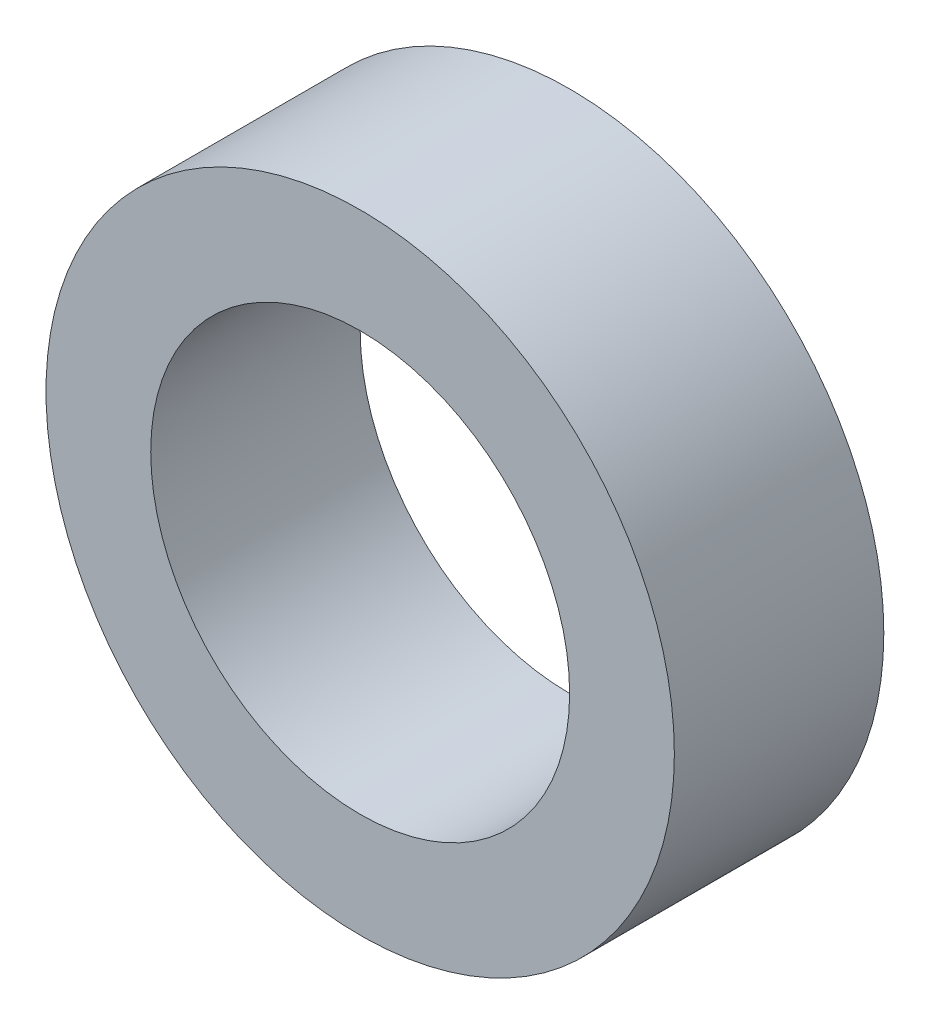
ISO-10303-21;
HEADER;
FILE_DESCRIPTION(('STEP AP214'),'2;1');
FILE_NAME('part.step','',(''),(''),'','','');
FILE_SCHEMA(('AUTOMOTIVE_DESIGN { 1 0 10303 214 1 1 1 1 }'));
ENDSEC;
DATA;
#1=APPLICATION_CONTEXT('core data for automotive mechanical design processes');
#2=APPLICATION_PROTOCOL_DEFINITION('international standard','automotive_design',2000,#1);
#3=PRODUCT_CONTEXT('',#1,'mechanical');
#4=PRODUCT('Part','Part','',(#3));
#5=PRODUCT_RELATED_PRODUCT_CATEGORY('part','',(#4));
#6=PRODUCT_DEFINITION_FORMATION('','',#4);
#7=PRODUCT_DEFINITION_CONTEXT('part definition',#1,'design');
#8=PRODUCT_DEFINITION('design','',#6,#7);
#9=PRODUCT_DEFINITION_SHAPE('','',#8);
#10=(LENGTH_UNIT() NAMED_UNIT(*) SI_UNIT(.MILLI.,.METRE.));
#11=(NAMED_UNIT(*) PLANE_ANGLE_UNIT() SI_UNIT($,.RADIAN.));
#12=(NAMED_UNIT(*) SI_UNIT($,.STERADIAN.) SOLID_ANGLE_UNIT());
#13=UNCERTAINTY_MEASURE_WITH_UNIT(LENGTH_MEASURE(1.E-05),#10,'distance_accuracy_value','');
#14=(GEOMETRIC_REPRESENTATION_CONTEXT(3) GLOBAL_UNCERTAINTY_ASSIGNED_CONTEXT((#13)) GLOBAL_UNIT_ASSIGNED_CONTEXT((#10,
#11,#12)) REPRESENTATION_CONTEXT('',''));
#15=CARTESIAN_POINT('',(0.,0.,0.));
#16=DIRECTION('',(0.,0.,1.));
#17=DIRECTION('',(1.,0.,0.));
#18=AXIS2_PLACEMENT_3D('',#15,#16,#17);
#19=CARTESIAN_POINT('',(0.,0.,4.));
#20=DIRECTION('',(0.,0.,1.));
#21=DIRECTION('',(1.,0.,0.));
#22=AXIS2_PLACEMENT_3D('',#19,#20,#21);
#23=PLANE('',#22);
#24=CARTESIAN_POINT('',(0.,0.,4.));
#25=DIRECTION('',(0.,0.,1.));
#26=DIRECTION('',(1.,0.,0.));
#27=AXIS2_PLACEMENT_3D('',#24,#25,#26);
#28=CIRCLE('',#27,6.);
#29=CARTESIAN_POINT('',(6.,0.,4.));
#30=VERTEX_POINT('',#29);
#31=EDGE_CURVE('E10',#30,#30,#28,.T.);
#32=ORIENTED_EDGE('',*,*,#31,.T.);
#33=EDGE_LOOP('',(#32));
#34=FACE_BOUND('',#33,.T.);
#35=CARTESIAN_POINT('',(0.,0.,4.));
#36=DIRECTION('',(0.,0.,1.));
#37=DIRECTION('',(1.,0.,0.));
#38=AXIS2_PLACEMENT_3D('',#35,#36,#37);
#39=CIRCLE('',#38,4.);
#40=CARTESIAN_POINT('',(4.,0.,4.));
#41=VERTEX_POINT('',#40);
#42=EDGE_CURVE('E41',#41,#41,#39,.T.);
#43=ORIENTED_EDGE('',*,*,#42,.F.);
#44=EDGE_LOOP('',(#43));
#45=FACE_BOUND('',#44,.T.);
#46=ADVANCED_FACE('F30',(#34,#45),#23,.T.);
#47=CARTESIAN_POINT('',(0.,0.,0.));
#48=DIRECTION('',(0.,0.,1.));
#49=DIRECTION('',(1.,0.,0.));
#50=AXIS2_PLACEMENT_3D('',#47,#48,#49);
#51=PLANE('',#50);
#52=CARTESIAN_POINT('',(0.,0.,0.));
#53=DIRECTION('',(0.,0.,1.));
#54=DIRECTION('',(1.,0.,0.));
#55=AXIS2_PLACEMENT_3D('',#52,#53,#54);
#56=CIRCLE('',#55,6.);
#57=CARTESIAN_POINT('',(6.,0.,0.));
#58=VERTEX_POINT('',#57);
#59=EDGE_CURVE('E34',#58,#58,#56,.T.);
#60=ORIENTED_EDGE('',*,*,#59,.F.);
#61=EDGE_LOOP('',(#60));
#62=FACE_BOUND('',#61,.T.);
#63=CARTESIAN_POINT('',(0.,0.,0.));
#64=DIRECTION('',(0.,0.,1.));
#65=DIRECTION('',(1.,0.,0.));
#66=AXIS2_PLACEMENT_3D('',#63,#64,#65);
#67=CIRCLE('',#66,4.);
#68=CARTESIAN_POINT('',(4.,0.,0.));
#69=VERTEX_POINT('',#68);
#70=EDGE_CURVE('E43',#69,#69,#67,.T.);
#71=ORIENTED_EDGE('',*,*,#70,.T.);
#72=EDGE_LOOP('',(#71));
#73=FACE_BOUND('',#72,.T.);
#74=ADVANCED_FACE('F53',(#62,#73),#51,.F.);
#75=CARTESIAN_POINT('',(0.,0.,4.));
#76=DIRECTION('',(0.,0.,-1.));
#77=DIRECTION('',(-1.,0.,0.));
#78=AXIS2_PLACEMENT_3D('',#75,#76,#77);
#79=CYLINDRICAL_SURFACE('',#78,6.);
#80=ORIENTED_EDGE('',*,*,#31,.F.);
#81=EDGE_LOOP('',(#80));
#82=FACE_BOUND('',#81,.T.);
#83=ORIENTED_EDGE('',*,*,#59,.T.);
#84=EDGE_LOOP('',(#83));
#85=FACE_BOUND('',#84,.T.);
#86=ADVANCED_FACE('F32',(#82,#85),#79,.T.);
#87=CARTESIAN_POINT('',(0.,0.,4.));
#88=DIRECTION('',(0.,0.,-1.));
#89=DIRECTION('',(-1.,0.,0.));
#90=AXIS2_PLACEMENT_3D('',#87,#88,#89);
#91=CYLINDRICAL_SURFACE('',#90,4.);
#92=ORIENTED_EDGE('',*,*,#42,.T.);
#93=EDGE_LOOP('',(#92));
#94=FACE_BOUND('',#93,.T.);
#95=ORIENTED_EDGE('',*,*,#70,.F.);
#96=EDGE_LOOP('',(#95));
#97=FACE_BOUND('',#96,.T.);
#98=ADVANCED_FACE('F49',(#94,#97),#91,.F.);
#99=CLOSED_SHELL('',(#46,#74,#86,#98));
#100=MANIFOLD_SOLID_BREP('B2',#99);
#101=ADVANCED_BREP_SHAPE_REPRESENTATION('',(#18,#100),#14);
#102=SHAPE_DEFINITION_REPRESENTATION(#9,#101);
ENDSEC;
END-ISO-10303-21;
